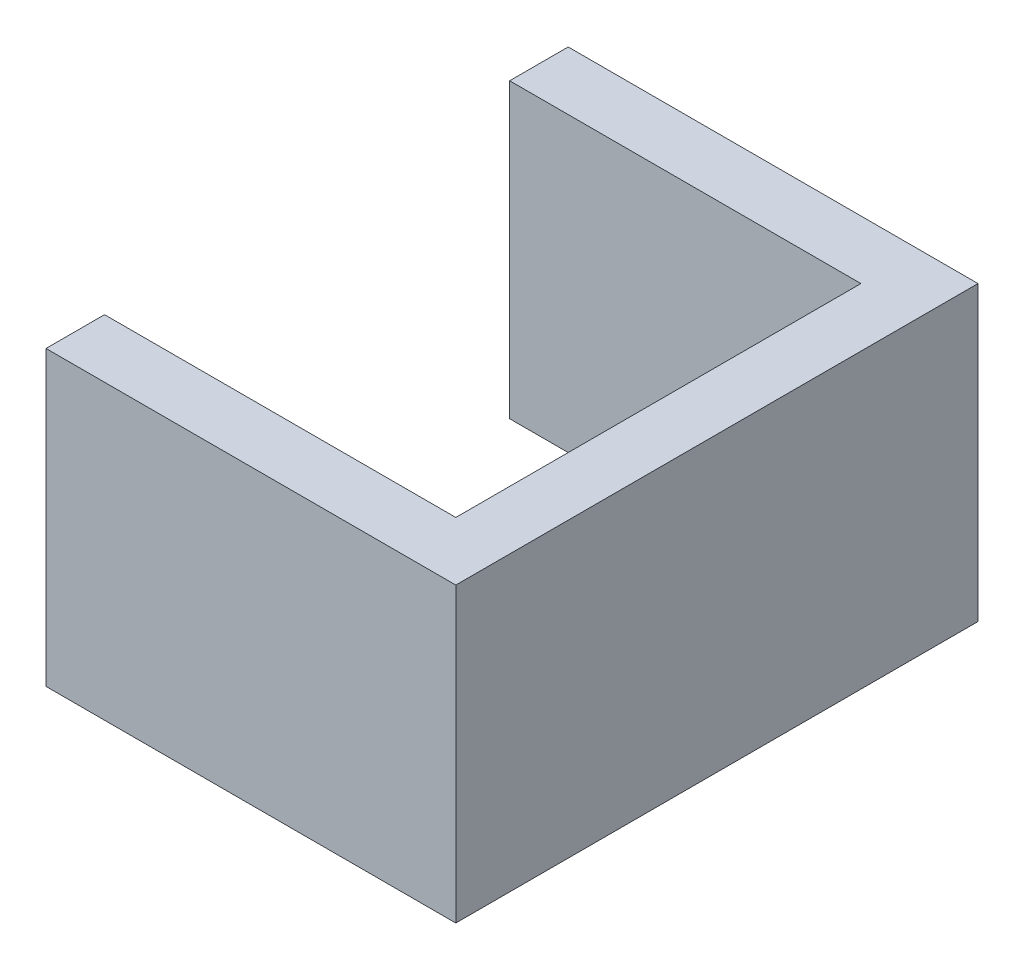
ISO-10303-21;
HEADER;
FILE_DESCRIPTION(('STEP AP214'),'2;1');
FILE_NAME('part.step','',(''),(''),'','','');
FILE_SCHEMA(('AUTOMOTIVE_DESIGN { 1 0 10303 214 1 1 1 1 }'));
ENDSEC;
DATA;
#1=APPLICATION_CONTEXT('core data for automotive mechanical design processes');
#2=APPLICATION_PROTOCOL_DEFINITION('international standard','automotive_design',2000,#1);
#3=PRODUCT_CONTEXT('',#1,'mechanical');
#4=PRODUCT('Part','Part','',(#3));
#5=PRODUCT_RELATED_PRODUCT_CATEGORY('part','',(#4));
#6=PRODUCT_DEFINITION_FORMATION('','',#4);
#7=PRODUCT_DEFINITION_CONTEXT('part definition',#1,'design');
#8=PRODUCT_DEFINITION('design','',#6,#7);
#9=PRODUCT_DEFINITION_SHAPE('','',#8);
#10=(LENGTH_UNIT() NAMED_UNIT(*) SI_UNIT(.MILLI.,.METRE.));
#11=(NAMED_UNIT(*) PLANE_ANGLE_UNIT() SI_UNIT($,.RADIAN.));
#12=(NAMED_UNIT(*) SI_UNIT($,.STERADIAN.) SOLID_ANGLE_UNIT());
#13=UNCERTAINTY_MEASURE_WITH_UNIT(LENGTH_MEASURE(1.E-05),#10,'distance_accuracy_value','');
#14=(GEOMETRIC_REPRESENTATION_CONTEXT(3) GLOBAL_UNCERTAINTY_ASSIGNED_CONTEXT((#13)) GLOBAL_UNIT_ASSIGNED_CONTEXT((#10,
#11,#12)) REPRESENTATION_CONTEXT('',''));
#15=CARTESIAN_POINT('',(0.,0.,0.));
#16=DIRECTION('',(0.,0.,1.));
#17=DIRECTION('',(1.,0.,0.));
#18=AXIS2_PLACEMENT_3D('',#15,#16,#17);
#19=CARTESIAN_POINT('',(-70.765034965035,50.,-44.8));
#20=DIRECTION('',(1.,0.,0.));
#21=DIRECTION('',(0.,0.,-1.));
#22=AXIS2_PLACEMENT_3D('',#19,#20,#21);
#23=PLANE('',#22);
#24=DIRECTION('',(0.,0.,1.));
#25=VECTOR('',#24,1.);
#26=CARTESIAN_POINT('',(-70.765034965035,0.,-44.8));
#27=LINE('',#26,#25);
#28=CARTESIAN_POINT('',(-70.765034965035,0.,-44.8));
#29=VERTEX_POINT('',#28);
#30=CARTESIAN_POINT('',(-70.765034965035,0.,-34.8));
#31=VERTEX_POINT('',#30);
#32=EDGE_CURVE('E129',#29,#31,#27,.T.);
#33=ORIENTED_EDGE('',*,*,#32,.T.);
#34=DIRECTION('',(0.,-1.,0.));
#35=VECTOR('',#34,1.);
#36=CARTESIAN_POINT('',(-70.765034965035,50.,-34.8));
#37=LINE('',#36,#35);
#38=CARTESIAN_POINT('',(-70.765034965035,50.,-34.8));
#39=VERTEX_POINT('',#38);
#40=EDGE_CURVE('E11',#39,#31,#37,.T.);
#41=ORIENTED_EDGE('',*,*,#40,.F.);
#42=DIRECTION('',(0.,0.,1.));
#43=VECTOR('',#42,1.);
#44=CARTESIAN_POINT('',(-70.765034965035,50.,-44.8));
#45=LINE('',#44,#43);
#46=CARTESIAN_POINT('',(-70.765034965035,50.,-44.8));
#47=VERTEX_POINT('',#46);
#48=EDGE_CURVE('E143',#47,#39,#45,.T.);
#49=ORIENTED_EDGE('',*,*,#48,.F.);
#50=DIRECTION('',(0.,-1.,0.));
#51=VECTOR('',#50,1.);
#52=CARTESIAN_POINT('',(-70.765034965035,50.,-44.8));
#53=LINE('',#52,#51);
#54=EDGE_CURVE('E125',#47,#29,#53,.T.);
#55=ORIENTED_EDGE('',*,*,#54,.T.);
#56=EDGE_LOOP('',(#33,#41,#49,#55));
#57=FACE_BOUND('',#56,.T.);
#58=ADVANCED_FACE('F33',(#57),#23,.F.);
#59=CARTESIAN_POINT('',(-70.765034965035,50.,-34.8));
#60=DIRECTION('',(0.,0.,-1.));
#61=DIRECTION('',(-1.,0.,0.));
#62=AXIS2_PLACEMENT_3D('',#59,#60,#61);
#63=PLANE('',#62);
#64=DIRECTION('',(1.,0.,0.));
#65=VECTOR('',#64,1.);
#66=CARTESIAN_POINT('',(-70.765034965035,0.,-34.8));
#67=LINE('',#66,#65);
#68=CARTESIAN_POINT('',(-10.765034965035,0.,-34.8));
#69=VERTEX_POINT('',#68);
#70=EDGE_CURVE('E132',#31,#69,#67,.T.);
#71=ORIENTED_EDGE('',*,*,#70,.T.);
#72=DIRECTION('',(0.,-1.,0.));
#73=VECTOR('',#72,1.);
#74=CARTESIAN_POINT('',(-10.765034965035,50.,-34.8));
#75=LINE('',#74,#73);
#76=CARTESIAN_POINT('',(-10.765034965035,50.,-34.8));
#77=VERTEX_POINT('',#76);
#78=EDGE_CURVE('E41',#77,#69,#75,.T.);
#79=ORIENTED_EDGE('',*,*,#78,.F.);
#80=DIRECTION('',(1.,0.,0.));
#81=VECTOR('',#80,1.);
#82=CARTESIAN_POINT('',(-70.765034965035,50.,-34.8));
#83=LINE('',#82,#81);
#84=EDGE_CURVE('E92',#39,#77,#83,.T.);
#85=ORIENTED_EDGE('',*,*,#84,.F.);
#86=ORIENTED_EDGE('',*,*,#40,.T.);
#87=EDGE_LOOP('',(#71,#79,#85,#86));
#88=FACE_BOUND('',#87,.T.);
#89=ADVANCED_FACE('F178',(#88),#63,.F.);
#90=CARTESIAN_POINT('',(-10.765034965035,50.,-34.8));
#91=DIRECTION('',(1.,0.,0.));
#92=DIRECTION('',(0.,0.,-1.));
#93=AXIS2_PLACEMENT_3D('',#90,#91,#92);
#94=PLANE('',#93);
#95=DIRECTION('',(0.,0.,1.));
#96=VECTOR('',#95,1.);
#97=CARTESIAN_POINT('',(-10.765034965035,0.,-34.8));
#98=LINE('',#97,#96);
#99=CARTESIAN_POINT('',(-10.765034965035,0.,34.4));
#100=VERTEX_POINT('',#99);
#101=EDGE_CURVE('E134',#69,#100,#98,.T.);
#102=ORIENTED_EDGE('',*,*,#101,.T.);
#103=DIRECTION('',(0.,-1.,0.));
#104=VECTOR('',#103,1.);
#105=CARTESIAN_POINT('',(-10.765034965035,50.,34.4));
#106=LINE('',#105,#104);
#107=CARTESIAN_POINT('',(-10.765034965035,50.,34.4));
#108=VERTEX_POINT('',#107);
#109=EDGE_CURVE('E150',#108,#100,#106,.T.);
#110=ORIENTED_EDGE('',*,*,#109,.F.);
#111=DIRECTION('',(0.,0.,1.));
#112=VECTOR('',#111,1.);
#113=CARTESIAN_POINT('',(-10.765034965035,50.,-34.8));
#114=LINE('',#113,#112);
#115=EDGE_CURVE('E158',#77,#108,#114,.T.);
#116=ORIENTED_EDGE('',*,*,#115,.F.);
#117=ORIENTED_EDGE('',*,*,#78,.T.);
#118=EDGE_LOOP('',(#102,#110,#116,#117));
#119=FACE_BOUND('',#118,.T.);
#120=ADVANCED_FACE('F156',(#119),#94,.F.);
#121=CARTESIAN_POINT('',(-10.765034965035,50.,34.4));
#122=DIRECTION('',(0.,0.,1.));
#123=DIRECTION('',(1.,0.,0.));
#124=AXIS2_PLACEMENT_3D('',#121,#122,#123);
#125=PLANE('',#124);
#126=DIRECTION('',(-1.,0.,0.));
#127=VECTOR('',#126,1.);
#128=CARTESIAN_POINT('',(-10.765034965035,0.,34.4));
#129=LINE('',#128,#127);
#130=CARTESIAN_POINT('',(-70.765034965035,0.,34.4));
#131=VERTEX_POINT('',#130);
#132=EDGE_CURVE('E136',#100,#131,#129,.T.);
#133=ORIENTED_EDGE('',*,*,#132,.T.);
#134=DIRECTION('',(0.,-1.,0.));
#135=VECTOR('',#134,1.);
#136=CARTESIAN_POINT('',(-70.765034965035,50.,34.4));
#137=LINE('',#136,#135);
#138=CARTESIAN_POINT('',(-70.765034965035,50.,34.4));
#139=VERTEX_POINT('',#138);
#140=EDGE_CURVE('E147',#139,#131,#137,.T.);
#141=ORIENTED_EDGE('',*,*,#140,.F.);
#142=DIRECTION('',(-1.,0.,0.));
#143=VECTOR('',#142,1.);
#144=CARTESIAN_POINT('',(-10.765034965035,50.,34.4));
#145=LINE('',#144,#143);
#146=EDGE_CURVE('E170',#108,#139,#145,.T.);
#147=ORIENTED_EDGE('',*,*,#146,.F.);
#148=ORIENTED_EDGE('',*,*,#109,.T.);
#149=EDGE_LOOP('',(#133,#141,#147,#148));
#150=FACE_BOUND('',#149,.T.);
#151=ADVANCED_FACE('F166',(#150),#125,.F.);
#152=CARTESIAN_POINT('',(-70.765034965035,50.,34.4));
#153=DIRECTION('',(1.,0.,0.));
#154=DIRECTION('',(0.,0.,-1.));
#155=AXIS2_PLACEMENT_3D('',#152,#153,#154);
#156=PLANE('',#155);
#157=DIRECTION('',(0.,0.,1.));
#158=VECTOR('',#157,1.);
#159=CARTESIAN_POINT('',(-70.765034965035,0.,34.4));
#160=LINE('',#159,#158);
#161=CARTESIAN_POINT('',(-70.765034965035,0.,44.4));
#162=VERTEX_POINT('',#161);
#163=EDGE_CURVE('E138',#131,#162,#160,.T.);
#164=ORIENTED_EDGE('',*,*,#163,.T.);
#165=DIRECTION('',(0.,-1.,0.));
#166=VECTOR('',#165,1.);
#167=CARTESIAN_POINT('',(-70.765034965035,50.,44.4));
#168=LINE('',#167,#166);
#169=CARTESIAN_POINT('',(-70.765034965035,50.,44.4));
#170=VERTEX_POINT('',#169);
#171=EDGE_CURVE('E120',#170,#162,#168,.T.);
#172=ORIENTED_EDGE('',*,*,#171,.F.);
#173=DIRECTION('',(0.,0.,1.));
#174=VECTOR('',#173,1.);
#175=CARTESIAN_POINT('',(-70.765034965035,50.,34.4));
#176=LINE('',#175,#174);
#177=EDGE_CURVE('E111',#139,#170,#176,.T.);
#178=ORIENTED_EDGE('',*,*,#177,.F.);
#179=ORIENTED_EDGE('',*,*,#140,.T.);
#180=EDGE_LOOP('',(#164,#172,#178,#179));
#181=FACE_BOUND('',#180,.T.);
#182=ADVANCED_FACE('F169',(#181),#156,.F.);
#183=CARTESIAN_POINT('',(-70.765034965035,50.,44.4));
#184=DIRECTION('',(0.,0.,-1.));
#185=DIRECTION('',(-1.,0.,0.));
#186=AXIS2_PLACEMENT_3D('',#183,#184,#185);
#187=PLANE('',#186);
#188=DIRECTION('',(1.,0.,0.));
#189=VECTOR('',#188,1.);
#190=CARTESIAN_POINT('',(-70.765034965035,0.,44.4));
#191=LINE('',#190,#189);
#192=CARTESIAN_POINT('',(-0.765034965035008,0.,44.4));
#193=VERTEX_POINT('',#192);
#194=EDGE_CURVE('E119',#162,#193,#191,.T.);
#195=ORIENTED_EDGE('',*,*,#194,.T.);
#196=DIRECTION('',(0.,-1.,0.));
#197=VECTOR('',#196,1.);
#198=CARTESIAN_POINT('',(-0.765034965035008,50.,44.4));
#199=LINE('',#198,#197);
#200=CARTESIAN_POINT('',(-0.765034965035008,50.,44.4));
#201=VERTEX_POINT('',#200);
#202=EDGE_CURVE('E116',#201,#193,#199,.T.);
#203=ORIENTED_EDGE('',*,*,#202,.F.);
#204=DIRECTION('',(1.,0.,0.));
#205=VECTOR('',#204,1.);
#206=CARTESIAN_POINT('',(-70.765034965035,50.,44.4));
#207=LINE('',#206,#205);
#208=EDGE_CURVE('E105',#170,#201,#207,.T.);
#209=ORIENTED_EDGE('',*,*,#208,.F.);
#210=ORIENTED_EDGE('',*,*,#171,.T.);
#211=EDGE_LOOP('',(#195,#203,#209,#210));
#212=FACE_BOUND('',#211,.T.);
#213=ADVANCED_FACE('F117',(#212),#187,.F.);
#214=CARTESIAN_POINT('',(-0.765034965035008,50.,44.4));
#215=DIRECTION('',(-1.,0.,0.));
#216=DIRECTION('',(0.,0.,1.));
#217=AXIS2_PLACEMENT_3D('',#214,#215,#216);
#218=PLANE('',#217);
#219=DIRECTION('',(0.,0.,-1.));
#220=VECTOR('',#219,1.);
#221=CARTESIAN_POINT('',(-0.765034965035008,0.,44.4));
#222=LINE('',#221,#220);
#223=CARTESIAN_POINT('',(-0.765034965035008,0.,-44.8));
#224=VERTEX_POINT('',#223);
#225=EDGE_CURVE('E78',#193,#224,#222,.T.);
#226=ORIENTED_EDGE('',*,*,#225,.T.);
#227=DIRECTION('',(0.,-1.,0.));
#228=VECTOR('',#227,1.);
#229=CARTESIAN_POINT('',(-0.765034965035008,50.,-44.8));
#230=LINE('',#229,#228);
#231=CARTESIAN_POINT('',(-0.765034965035008,50.,-44.8));
#232=VERTEX_POINT('',#231);
#233=EDGE_CURVE('E121',#232,#224,#230,.T.);
#234=ORIENTED_EDGE('',*,*,#233,.F.);
#235=DIRECTION('',(0.,0.,-1.));
#236=VECTOR('',#235,1.);
#237=CARTESIAN_POINT('',(-0.765034965035008,50.,44.4));
#238=LINE('',#237,#236);
#239=EDGE_CURVE('E109',#201,#232,#238,.T.);
#240=ORIENTED_EDGE('',*,*,#239,.F.);
#241=ORIENTED_EDGE('',*,*,#202,.T.);
#242=EDGE_LOOP('',(#226,#234,#240,#241));
#243=FACE_BOUND('',#242,.T.);
#244=ADVANCED_FACE('F123',(#243),#218,.F.);
#245=CARTESIAN_POINT('',(-0.765034965035008,50.,-44.8));
#246=DIRECTION('',(0.,0.,1.));
#247=DIRECTION('',(1.,0.,0.));
#248=AXIS2_PLACEMENT_3D('',#245,#246,#247);
#249=PLANE('',#248);
#250=DIRECTION('',(-1.,0.,0.));
#251=VECTOR('',#250,1.);
#252=CARTESIAN_POINT('',(-0.765034965035008,0.,-44.8));
#253=LINE('',#252,#251);
#254=EDGE_CURVE('E84',#224,#29,#253,.T.);
#255=ORIENTED_EDGE('',*,*,#254,.T.);
#256=ORIENTED_EDGE('',*,*,#54,.F.);
#257=DIRECTION('',(-1.,0.,0.));
#258=VECTOR('',#257,1.);
#259=CARTESIAN_POINT('',(-0.765034965035008,50.,-44.8));
#260=LINE('',#259,#258);
#261=EDGE_CURVE('E49',#232,#47,#260,.T.);
#262=ORIENTED_EDGE('',*,*,#261,.F.);
#263=ORIENTED_EDGE('',*,*,#233,.T.);
#264=EDGE_LOOP('',(#255,#256,#262,#263));
#265=FACE_BOUND('',#264,.T.);
#266=ADVANCED_FACE('F194',(#265),#249,.F.);
#267=CARTESIAN_POINT('',(0.,50.,0.));
#268=DIRECTION('',(0.,1.,0.));
#269=DIRECTION('',(0.,0.,1.));
#270=AXIS2_PLACEMENT_3D('',#267,#268,#269);
#271=PLANE('',#270);
#272=ORIENTED_EDGE('',*,*,#48,.T.);
#273=ORIENTED_EDGE('',*,*,#84,.T.);
#274=ORIENTED_EDGE('',*,*,#115,.T.);
#275=ORIENTED_EDGE('',*,*,#146,.T.);
#276=ORIENTED_EDGE('',*,*,#177,.T.);
#277=ORIENTED_EDGE('',*,*,#208,.T.);
#278=ORIENTED_EDGE('',*,*,#239,.T.);
#279=ORIENTED_EDGE('',*,*,#261,.T.);
#280=EDGE_LOOP('',(#272,#273,#274,#275,#276,#277,#278,#279));
#281=FACE_BOUND('',#280,.T.);
#282=ADVANCED_FACE('F107',(#281),#271,.T.);
#283=CARTESIAN_POINT('',(0.,0.,0.));
#284=DIRECTION('',(0.,1.,0.));
#285=DIRECTION('',(0.,0.,1.));
#286=AXIS2_PLACEMENT_3D('',#283,#284,#285);
#287=PLANE('',#286);
#288=ORIENTED_EDGE('',*,*,#32,.F.);
#289=ORIENTED_EDGE('',*,*,#254,.F.);
#290=ORIENTED_EDGE('',*,*,#225,.F.);
#291=ORIENTED_EDGE('',*,*,#194,.F.);
#292=ORIENTED_EDGE('',*,*,#163,.F.);
#293=ORIENTED_EDGE('',*,*,#132,.F.);
#294=ORIENTED_EDGE('',*,*,#101,.F.);
#295=ORIENTED_EDGE('',*,*,#70,.F.);
#296=EDGE_LOOP('',(#288,#289,#290,#291,#292,#293,#294,#295));
#297=FACE_BOUND('',#296,.T.);
#298=ADVANCED_FACE('F162',(#297),#287,.F.);
#299=CLOSED_SHELL('',(#58,#89,#120,#151,#182,#213,#244,#266,#282,#298));
#300=MANIFOLD_SOLID_BREP('B2',#299);
#301=ADVANCED_BREP_SHAPE_REPRESENTATION('',(#18,#300),#14);
#302=SHAPE_DEFINITION_REPRESENTATION(#9,#301);
ENDSEC;
END-ISO-10303-21;
